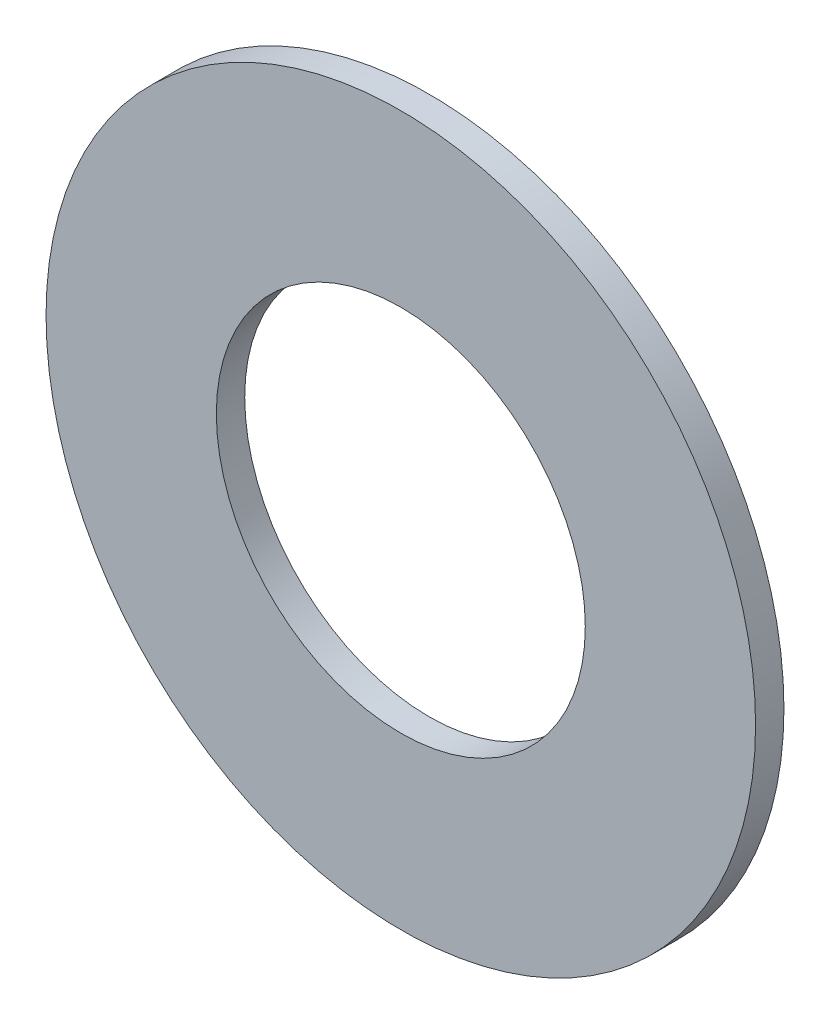
ISO-10303-21;
HEADER;
FILE_DESCRIPTION(('STEP AP214'),'2;1');
FILE_NAME('part.step','',(''),(''),'','','');
FILE_SCHEMA(('AUTOMOTIVE_DESIGN { 1 0 10303 214 1 1 1 1 }'));
ENDSEC;
DATA;
#1=APPLICATION_CONTEXT('core data for automotive mechanical design processes');
#2=APPLICATION_PROTOCOL_DEFINITION('international standard','automotive_design',2000,#1);
#3=PRODUCT_CONTEXT('',#1,'mechanical');
#4=PRODUCT('Part','Part','',(#3));
#5=PRODUCT_RELATED_PRODUCT_CATEGORY('part','',(#4));
#6=PRODUCT_DEFINITION_FORMATION('','',#4);
#7=PRODUCT_DEFINITION_CONTEXT('part definition',#1,'design');
#8=PRODUCT_DEFINITION('design','',#6,#7);
#9=PRODUCT_DEFINITION_SHAPE('','',#8);
#10=(LENGTH_UNIT() NAMED_UNIT(*) SI_UNIT(.MILLI.,.METRE.));
#11=(NAMED_UNIT(*) PLANE_ANGLE_UNIT() SI_UNIT($,.RADIAN.));
#12=(NAMED_UNIT(*) SI_UNIT($,.STERADIAN.) SOLID_ANGLE_UNIT());
#13=UNCERTAINTY_MEASURE_WITH_UNIT(LENGTH_MEASURE(1.E-05),#10,'distance_accuracy_value','');
#14=(GEOMETRIC_REPRESENTATION_CONTEXT(3) GLOBAL_UNCERTAINTY_ASSIGNED_CONTEXT((#13)) GLOBAL_UNIT_ASSIGNED_CONTEXT((#10,
#11,#12)) REPRESENTATION_CONTEXT('',''));
#15=CARTESIAN_POINT('',(0.,0.,0.));
#16=DIRECTION('',(0.,0.,1.));
#17=DIRECTION('',(1.,0.,0.));
#18=AXIS2_PLACEMENT_3D('',#15,#16,#17);
#19=CARTESIAN_POINT('',(0.,0.,-0.508));
#20=DIRECTION('',(0.,0.,1.));
#21=DIRECTION('',(1.,0.,0.));
#22=AXIS2_PLACEMENT_3D('',#19,#20,#21);
#23=CYLINDRICAL_SURFACE('',#22,6.35);
#24=CARTESIAN_POINT('',(0.,0.,-0.508));
#25=DIRECTION('',(0.,0.,1.));
#26=DIRECTION('',(1.,0.,0.));
#27=AXIS2_PLACEMENT_3D('',#24,#25,#26);
#28=CIRCLE('',#27,6.35);
#29=CARTESIAN_POINT('',(6.35,0.,-0.508));
#30=VERTEX_POINT('',#29);
#31=EDGE_CURVE('E10',#30,#30,#28,.T.);
#32=ORIENTED_EDGE('',*,*,#31,.T.);
#33=EDGE_LOOP('',(#32));
#34=FACE_BOUND('',#33,.T.);
#35=CARTESIAN_POINT('',(0.,0.,0.));
#36=DIRECTION('',(0.,0.,1.));
#37=DIRECTION('',(1.,0.,0.));
#38=AXIS2_PLACEMENT_3D('',#35,#36,#37);
#39=CIRCLE('',#38,6.35);
#40=CARTESIAN_POINT('',(6.35,0.,0.));
#41=VERTEX_POINT('',#40);
#42=EDGE_CURVE('E35',#41,#41,#39,.T.);
#43=ORIENTED_EDGE('',*,*,#42,.F.);
#44=EDGE_LOOP('',(#43));
#45=FACE_BOUND('',#44,.T.);
#46=ADVANCED_FACE('F32',(#34,#45),#23,.T.);
#47=CARTESIAN_POINT('',(0.,0.,-0.508));
#48=DIRECTION('',(0.,0.,1.));
#49=DIRECTION('',(1.,0.,0.));
#50=AXIS2_PLACEMENT_3D('',#47,#48,#49);
#51=PLANE('',#50);
#52=CARTESIAN_POINT('',(0.,0.,-0.508));
#53=DIRECTION('',(0.,0.,1.));
#54=DIRECTION('',(1.,0.,0.));
#55=AXIS2_PLACEMENT_3D('',#52,#53,#54);
#56=CIRCLE('',#55,3.302);
#57=CARTESIAN_POINT('',(3.302,0.,-0.508));
#58=VERTEX_POINT('',#57);
#59=EDGE_CURVE('E42',#58,#58,#56,.T.);
#60=ORIENTED_EDGE('',*,*,#59,.T.);
#61=EDGE_LOOP('',(#60));
#62=FACE_BOUND('',#61,.T.);
#63=ORIENTED_EDGE('',*,*,#31,.F.);
#64=EDGE_LOOP('',(#63));
#65=FACE_BOUND('',#64,.T.);
#66=ADVANCED_FACE('F50',(#62,#65),#51,.F.);
#67=CARTESIAN_POINT('',(0.,0.,0.));
#68=DIRECTION('',(0.,0.,1.));
#69=DIRECTION('',(1.,0.,0.));
#70=AXIS2_PLACEMENT_3D('',#67,#68,#69);
#71=PLANE('',#70);
#72=CARTESIAN_POINT('',(0.,0.,0.));
#73=DIRECTION('',(0.,0.,1.));
#74=DIRECTION('',(1.,0.,0.));
#75=AXIS2_PLACEMENT_3D('',#72,#73,#74);
#76=CIRCLE('',#75,3.302);
#77=CARTESIAN_POINT('',(3.302,0.,0.));
#78=VERTEX_POINT('',#77);
#79=EDGE_CURVE('E44',#78,#78,#76,.T.);
#80=ORIENTED_EDGE('',*,*,#79,.F.);
#81=EDGE_LOOP('',(#80));
#82=FACE_BOUND('',#81,.T.);
#83=ORIENTED_EDGE('',*,*,#42,.T.);
#84=EDGE_LOOP('',(#83));
#85=FACE_BOUND('',#84,.T.);
#86=ADVANCED_FACE('F56',(#82,#85),#71,.T.);
#87=CARTESIAN_POINT('',(0.,0.,-0.508));
#88=DIRECTION('',(0.,0.,1.));
#89=DIRECTION('',(1.,0.,0.));
#90=AXIS2_PLACEMENT_3D('',#87,#88,#89);
#91=CYLINDRICAL_SURFACE('',#90,3.302);
#92=ORIENTED_EDGE('',*,*,#59,.F.);
#93=EDGE_LOOP('',(#92));
#94=FACE_BOUND('',#93,.T.);
#95=ORIENTED_EDGE('',*,*,#79,.T.);
#96=EDGE_LOOP('',(#95));
#97=FACE_BOUND('',#96,.T.);
#98=ADVANCED_FACE('F53',(#94,#97),#91,.F.);
#99=CLOSED_SHELL('',(#46,#66,#86,#98));
#100=MANIFOLD_SOLID_BREP('B2',#99);
#101=ADVANCED_BREP_SHAPE_REPRESENTATION('',(#18,#100),#14);
#102=SHAPE_DEFINITION_REPRESENTATION(#9,#101);
ENDSEC;
END-ISO-10303-21;
